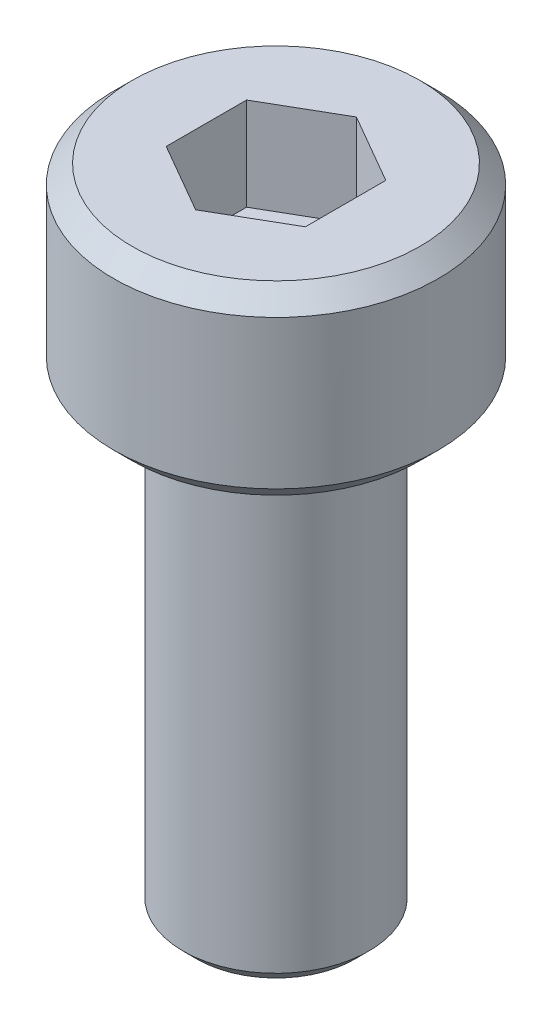
ISO-10303-21;
HEADER;
FILE_DESCRIPTION(('STEP AP214'),'2;1');
FILE_NAME('part.step','',(''),(''),'','','');
FILE_SCHEMA(('AUTOMOTIVE_DESIGN { 1 0 10303 214 1 1 1 1 }'));
ENDSEC;
DATA;
#1=APPLICATION_CONTEXT('core data for automotive mechanical design processes');
#2=APPLICATION_PROTOCOL_DEFINITION('international standard','automotive_design',2000,#1);
#3=PRODUCT_CONTEXT('',#1,'mechanical');
#4=PRODUCT('Part','Part','',(#3));
#5=PRODUCT_RELATED_PRODUCT_CATEGORY('part','',(#4));
#6=PRODUCT_DEFINITION_FORMATION('','',#4);
#7=PRODUCT_DEFINITION_CONTEXT('part definition',#1,'design');
#8=PRODUCT_DEFINITION('design','',#6,#7);
#9=PRODUCT_DEFINITION_SHAPE('','',#8);
#10=(LENGTH_UNIT() NAMED_UNIT(*) SI_UNIT(.MILLI.,.METRE.));
#11=(NAMED_UNIT(*) PLANE_ANGLE_UNIT() SI_UNIT($,.RADIAN.));
#12=(NAMED_UNIT(*) SI_UNIT($,.STERADIAN.) SOLID_ANGLE_UNIT());
#13=UNCERTAINTY_MEASURE_WITH_UNIT(LENGTH_MEASURE(1.E-05),#10,'distance_accuracy_value','');
#14=(GEOMETRIC_REPRESENTATION_CONTEXT(3) GLOBAL_UNCERTAINTY_ASSIGNED_CONTEXT((#13)) GLOBAL_UNIT_ASSIGNED_CONTEXT((#10,
#11,#12)) REPRESENTATION_CONTEXT('',''));
#15=CARTESIAN_POINT('',(0.,0.,0.));
#16=DIRECTION('',(0.,0.,1.));
#17=DIRECTION('',(1.,0.,0.));
#18=AXIS2_PLACEMENT_3D('',#15,#16,#17);
#19=CARTESIAN_POINT('',(0.,2.,-1.73205080756888));
#20=DIRECTION('',(-0.500000000000001,0.,-0.866025403784438));
#21=DIRECTION('',(-0.866025403784438,0.,0.500000000000001));
#22=AXIS2_PLACEMENT_3D('',#19,#20,#21);
#23=PLANE('',#22);
#24=DIRECTION('',(0.,1.,0.));
#25=VECTOR('',#24,1.);
#26=CARTESIAN_POINT('',(-1.5,2.,-0.866025403784438));
#27=LINE('',#26,#25);
#28=CARTESIAN_POINT('',(-1.5,4.,-0.866025403784437));
#29=VERTEX_POINT('',#28);
#30=CARTESIAN_POINT('',(-1.5,2.,-0.866025403784437));
#31=VERTEX_POINT('',#30);
#32=EDGE_CURVE('E82',#29,#31,#27,.F.);
#33=ORIENTED_EDGE('',*,*,#32,.T.);
#34=DIRECTION('',(-0.866025403784438,0.,0.500000000000001));
#35=VECTOR('',#34,1.);
#36=CARTESIAN_POINT('',(0.,2.,-1.73205080756888));
#37=LINE('',#36,#35);
#38=CARTESIAN_POINT('',(0.,2.,-1.73205080756888));
#39=VERTEX_POINT('',#38);
#40=EDGE_CURVE('E71',#39,#31,#37,.T.);
#41=ORIENTED_EDGE('',*,*,#40,.F.);
#42=DIRECTION('',(0.,1.,0.));
#43=VECTOR('',#42,1.);
#44=CARTESIAN_POINT('',(0.,2.,-1.73205080756888));
#45=LINE('',#44,#43);
#46=CARTESIAN_POINT('',(0.,4.,-1.73205080756888));
#47=VERTEX_POINT('',#46);
#48=EDGE_CURVE('E91',#39,#47,#45,.T.);
#49=ORIENTED_EDGE('',*,*,#48,.T.);
#50=DIRECTION('',(-0.866025403784438,0.,0.500000000000001));
#51=VECTOR('',#50,1.);
#52=CARTESIAN_POINT('',(0.,4.,-1.73205080756888));
#53=LINE('',#52,#51);
#54=EDGE_CURVE('E66',#29,#47,#53,.F.);
#55=ORIENTED_EDGE('',*,*,#54,.F.);
#56=EDGE_LOOP('',(#33,#41,#49,#55));
#57=FACE_BOUND('',#56,.T.);
#58=ADVANCED_FACE('F16',(#57),#23,.F.);
#59=CARTESIAN_POINT('',(-1.5,2.,-0.866025403784438));
#60=DIRECTION('',(-1.,0.,0.));
#61=DIRECTION('',(0.,0.,1.));
#62=AXIS2_PLACEMENT_3D('',#59,#60,#61);
#63=PLANE('',#62);
#64=DIRECTION('',(0.,1.,0.));
#65=VECTOR('',#64,1.);
#66=CARTESIAN_POINT('',(-1.5,2.,0.866025403784439));
#67=LINE('',#66,#65);
#68=CARTESIAN_POINT('',(-1.5,4.,0.866025403784439));
#69=VERTEX_POINT('',#68);
#70=CARTESIAN_POINT('',(-1.5,2.,0.866025403784439));
#71=VERTEX_POINT('',#70);
#72=EDGE_CURVE('E87',#69,#71,#67,.F.);
#73=ORIENTED_EDGE('',*,*,#72,.T.);
#74=DIRECTION('',(0.,0.,1.));
#75=VECTOR('',#74,1.);
#76=CARTESIAN_POINT('',(-1.5,2.,-0.866025403784438));
#77=LINE('',#76,#75);
#78=EDGE_CURVE('E75',#31,#71,#77,.T.);
#79=ORIENTED_EDGE('',*,*,#78,.F.);
#80=ORIENTED_EDGE('',*,*,#32,.F.);
#81=DIRECTION('',(0.,0.,1.));
#82=VECTOR('',#81,1.);
#83=CARTESIAN_POINT('',(-1.5,4.,-0.866025403784438));
#84=LINE('',#83,#82);
#85=EDGE_CURVE('E89',#69,#29,#84,.F.);
#86=ORIENTED_EDGE('',*,*,#85,.F.);
#87=EDGE_LOOP('',(#73,#79,#80,#86));
#88=FACE_BOUND('',#87,.T.);
#89=ADVANCED_FACE('F85',(#88),#63,.F.);
#90=CARTESIAN_POINT('',(1.5,2.,-0.866025403784438));
#91=DIRECTION('',(0.5,0.,-0.866025403784439));
#92=DIRECTION('',(-0.866025403784439,0.,-0.5));
#93=AXIS2_PLACEMENT_3D('',#90,#91,#92);
#94=PLANE('',#93);
#95=ORIENTED_EDGE('',*,*,#48,.F.);
#96=DIRECTION('',(-0.866025403784439,0.,-0.5));
#97=VECTOR('',#96,1.);
#98=CARTESIAN_POINT('',(1.5,2.,-0.866025403784438));
#99=LINE('',#98,#97);
#100=CARTESIAN_POINT('',(1.5,2.,-0.866025403784438));
#101=VERTEX_POINT('',#100);
#102=EDGE_CURVE('E78',#101,#39,#99,.T.);
#103=ORIENTED_EDGE('',*,*,#102,.F.);
#104=DIRECTION('',(0.,1.,0.));
#105=VECTOR('',#104,1.);
#106=CARTESIAN_POINT('',(1.5,2.,-0.866025403784438));
#107=LINE('',#106,#105);
#108=CARTESIAN_POINT('',(1.5,4.,-0.866025403784438));
#109=VERTEX_POINT('',#108);
#110=EDGE_CURVE('E124',#101,#109,#107,.T.);
#111=ORIENTED_EDGE('',*,*,#110,.T.);
#112=DIRECTION('',(-0.866025403784439,0.,-0.5));
#113=VECTOR('',#112,1.);
#114=CARTESIAN_POINT('',(1.5,4.,-0.866025403784438));
#115=LINE('',#114,#113);
#116=EDGE_CURVE('E136',#47,#109,#115,.F.);
#117=ORIENTED_EDGE('',*,*,#116,.F.);
#118=EDGE_LOOP('',(#95,#103,#111,#117));
#119=FACE_BOUND('',#118,.T.);
#120=ADVANCED_FACE('F139',(#119),#94,.F.);
#121=CARTESIAN_POINT('',(-1.5,2.,0.866025403784439));
#122=DIRECTION('',(-0.499999999999999,0.,0.866025403784439));
#123=DIRECTION('',(0.866025403784439,0.,0.499999999999999));
#124=AXIS2_PLACEMENT_3D('',#121,#122,#123);
#125=PLANE('',#124);
#126=DIRECTION('',(0.,1.,0.));
#127=VECTOR('',#126,1.);
#128=CARTESIAN_POINT('',(0.,2.,1.73205080756888));
#129=LINE('',#128,#127);
#130=CARTESIAN_POINT('',(0.,4.,1.73205080756888));
#131=VERTEX_POINT('',#130);
#132=CARTESIAN_POINT('',(0.,2.,1.73205080756888));
#133=VERTEX_POINT('',#132);
#134=EDGE_CURVE('E121',#131,#133,#129,.F.);
#135=ORIENTED_EDGE('',*,*,#134,.T.);
#136=DIRECTION('',(0.866025403784439,0.,0.499999999999999));
#137=VECTOR('',#136,1.);
#138=CARTESIAN_POINT('',(-1.5,2.,0.866025403784439));
#139=LINE('',#138,#137);
#140=EDGE_CURVE('E130',#71,#133,#139,.T.);
#141=ORIENTED_EDGE('',*,*,#140,.F.);
#142=ORIENTED_EDGE('',*,*,#72,.F.);
#143=DIRECTION('',(0.866025403784439,0.,0.499999999999999));
#144=VECTOR('',#143,1.);
#145=CARTESIAN_POINT('',(-1.5,4.,0.866025403784439));
#146=LINE('',#145,#144);
#147=EDGE_CURVE('E132',#131,#69,#146,.F.);
#148=ORIENTED_EDGE('',*,*,#147,.F.);
#149=EDGE_LOOP('',(#135,#141,#142,#148));
#150=FACE_BOUND('',#149,.T.);
#151=ADVANCED_FACE('F146',(#150),#125,.F.);
#152=CARTESIAN_POINT('',(1.5,2.,2.59807621135331));
#153=DIRECTION('',(0.,1.,0.));
#154=DIRECTION('',(0.,0.,1.));
#155=AXIS2_PLACEMENT_3D('',#152,#153,#154);
#156=PLANE('',#155);
#157=ORIENTED_EDGE('',*,*,#40,.T.);
#158=ORIENTED_EDGE('',*,*,#78,.T.);
#159=ORIENTED_EDGE('',*,*,#140,.T.);
#160=DIRECTION('',(0.866025403784438,0.,-0.5));
#161=VECTOR('',#160,1.);
#162=CARTESIAN_POINT('',(0.,2.,1.73205080756888));
#163=LINE('',#162,#161);
#164=CARTESIAN_POINT('',(1.5,2.,0.866025403784438));
#165=VERTEX_POINT('',#164);
#166=EDGE_CURVE('E119',#133,#165,#163,.T.);
#167=ORIENTED_EDGE('',*,*,#166,.T.);
#168=DIRECTION('',(0.,0.,-1.));
#169=VECTOR('',#168,1.);
#170=CARTESIAN_POINT('',(1.5,2.,0.866025403784438));
#171=LINE('',#170,#169);
#172=EDGE_CURVE('E127',#165,#101,#171,.T.);
#173=ORIENTED_EDGE('',*,*,#172,.T.);
#174=ORIENTED_EDGE('',*,*,#102,.T.);
#175=EDGE_LOOP('',(#157,#158,#159,#167,#173,#174));
#176=FACE_BOUND('',#175,.T.);
#177=ADVANCED_FACE('F72',(#176),#156,.T.);
#178=CARTESIAN_POINT('',(1.5,2.,0.866025403784438));
#179=DIRECTION('',(1.,0.,0.));
#180=DIRECTION('',(0.,0.,-1.));
#181=AXIS2_PLACEMENT_3D('',#178,#179,#180);
#182=PLANE('',#181);
#183=ORIENTED_EDGE('',*,*,#110,.F.);
#184=ORIENTED_EDGE('',*,*,#172,.F.);
#185=DIRECTION('',(0.,1.,0.));
#186=VECTOR('',#185,1.);
#187=CARTESIAN_POINT('',(1.5,2.,0.866025403784437));
#188=LINE('',#187,#186);
#189=CARTESIAN_POINT('',(1.5,4.,0.866025403784438));
#190=VERTEX_POINT('',#189);
#191=EDGE_CURVE('E117',#165,#190,#188,.T.);
#192=ORIENTED_EDGE('',*,*,#191,.T.);
#193=DIRECTION('',(0.,0.,-1.));
#194=VECTOR('',#193,1.);
#195=CARTESIAN_POINT('',(1.5,4.,0.866025403784438));
#196=LINE('',#195,#194);
#197=EDGE_CURVE('E34',#109,#190,#196,.F.);
#198=ORIENTED_EDGE('',*,*,#197,.F.);
#199=EDGE_LOOP('',(#183,#184,#192,#198));
#200=FACE_BOUND('',#199,.T.);
#201=ADVANCED_FACE('F153',(#200),#182,.F.);
#202=CARTESIAN_POINT('',(0.,2.,1.73205080756888));
#203=DIRECTION('',(0.5,0.,0.866025403784438));
#204=DIRECTION('',(0.866025403784438,0.,-0.5));
#205=AXIS2_PLACEMENT_3D('',#202,#203,#204);
#206=PLANE('',#205);
#207=ORIENTED_EDGE('',*,*,#191,.F.);
#208=ORIENTED_EDGE('',*,*,#166,.F.);
#209=ORIENTED_EDGE('',*,*,#134,.F.);
#210=DIRECTION('',(-0.866025403784438,0.,0.5));
#211=VECTOR('',#210,1.);
#212=CARTESIAN_POINT('',(1.5,4.,0.866025403784438));
#213=LINE('',#212,#211);
#214=EDGE_CURVE('E115',#190,#131,#213,.T.);
#215=ORIENTED_EDGE('',*,*,#214,.F.);
#216=EDGE_LOOP('',(#207,#208,#209,#215));
#217=FACE_BOUND('',#216,.T.);
#218=ADVANCED_FACE('F151',(#217),#206,.F.);
#219=CARTESIAN_POINT('',(0.,4.,0.));
#220=DIRECTION('',(0.,1.,0.));
#221=DIRECTION('',(0.,0.,1.));
#222=AXIS2_PLACEMENT_3D('',#219,#220,#221);
#223=PLANE('',#222);
#224=ORIENTED_EDGE('',*,*,#197,.T.);
#225=ORIENTED_EDGE('',*,*,#214,.T.);
#226=ORIENTED_EDGE('',*,*,#147,.T.);
#227=ORIENTED_EDGE('',*,*,#85,.T.);
#228=ORIENTED_EDGE('',*,*,#54,.T.);
#229=ORIENTED_EDGE('',*,*,#116,.T.);
#230=EDGE_LOOP('',(#224,#225,#226,#227,#228,#229));
#231=FACE_BOUND('',#230,.T.);
#232=CARTESIAN_POINT('',(0.,4.0000000000191,0.));
#233=DIRECTION('',(0.,-1.,0.));
#234=DIRECTION('',(0.,0.,-1.));
#235=AXIS2_PLACEMENT_3D('',#232,#233,#234);
#236=CIRCLE('',#235,3.10000000001764);
#237=CARTESIAN_POINT('',(0.,4.0000000000191,-3.10000000001764));
#238=VERTEX_POINT('',#237);
#239=EDGE_CURVE('E19',#238,#238,#236,.T.);
#240=ORIENTED_EDGE('',*,*,#239,.F.);
#241=EDGE_LOOP('',(#240));
#242=FACE_BOUND('',#241,.T.);
#243=ADVANCED_FACE('F141',(#231,#242),#223,.T.);
#244=CARTESIAN_POINT('',(0.,3.60000000000582,0.));
#245=DIRECTION('',(0.,-1.,0.));
#246=DIRECTION('',(0.,0.,-1.));
#247=AXIS2_PLACEMENT_3D('',#244,#245,#246);
#248=CONICAL_SURFACE('',#247,3.50000000003092,0.785398163397448);
#249=ORIENTED_EDGE('',*,*,#239,.T.);
#250=EDGE_LOOP('',(#249));
#251=FACE_BOUND('',#250,.T.);
#252=CARTESIAN_POINT('',(0.,3.6,0.));
#253=DIRECTION('',(0.,-1.,0.));
#254=DIRECTION('',(0.,0.,-1.));
#255=AXIS2_PLACEMENT_3D('',#252,#253,#254);
#256=CIRCLE('',#255,3.5);
#257=CARTESIAN_POINT('',(0.,3.6,-3.5));
#258=VERTEX_POINT('',#257);
#259=EDGE_CURVE('E106',#258,#258,#256,.T.);
#260=ORIENTED_EDGE('',*,*,#259,.F.);
#261=EDGE_LOOP('',(#260));
#262=FACE_BOUND('',#261,.T.);
#263=ADVANCED_FACE('F190',(#251,#262),#248,.T.);
#264=CARTESIAN_POINT('',(0.,4.,0.));
#265=DIRECTION('',(0.,-1.,0.));
#266=DIRECTION('',(0.,0.,-1.));
#267=AXIS2_PLACEMENT_3D('',#264,#265,#266);
#268=CYLINDRICAL_SURFACE('',#267,3.5);
#269=ORIENTED_EDGE('',*,*,#259,.T.);
#270=EDGE_LOOP('',(#269));
#271=FACE_BOUND('',#270,.T.);
#272=CARTESIAN_POINT('',(0.,0.400000000013279,0.));
#273=DIRECTION('',(0.,1.,0.));
#274=DIRECTION('',(0.,0.,1.));
#275=AXIS2_PLACEMENT_3D('',#272,#273,#274);
#276=CIRCLE('',#275,3.50000000003092);
#277=CARTESIAN_POINT('',(0.,0.400000000013279,3.50000000003092));
#278=VERTEX_POINT('',#277);
#279=EDGE_CURVE('E101',#278,#278,#276,.F.);
#280=ORIENTED_EDGE('',*,*,#279,.F.);
#281=EDGE_LOOP('',(#280));
#282=FACE_BOUND('',#281,.T.);
#283=ADVANCED_FACE('F186',(#271,#282),#268,.T.);
#284=CARTESIAN_POINT('',(0.,-10.,0.));
#285=DIRECTION('',(0.,1.,0.));
#286=DIRECTION('',(0.,0.,1.));
#287=AXIS2_PLACEMENT_3D('',#284,#285,#286);
#288=PLANE('',#287);
#289=CARTESIAN_POINT('',(0.,-9.99999999999091,0.));
#290=DIRECTION('',(0.,1.,0.));
#291=DIRECTION('',(0.,0.,1.));
#292=AXIS2_PLACEMENT_3D('',#289,#290,#291);
#293=CIRCLE('',#292,1.70000000008486);
#294=CARTESIAN_POINT('',(0.,-9.99999999999091,1.70000000008486));
#295=VERTEX_POINT('',#294);
#296=EDGE_CURVE('E99',#295,#295,#293,.T.);
#297=ORIENTED_EDGE('',*,*,#296,.F.);
#298=EDGE_LOOP('',(#297));
#299=FACE_BOUND('',#298,.T.);
#300=ADVANCED_FACE('F182',(#299),#288,.F.);
#301=CARTESIAN_POINT('',(0.,0.399999999956435,0.));
#302=DIRECTION('',(0.,1.,0.));
#303=DIRECTION('',(0.,0.,1.));
#304=AXIS2_PLACEMENT_3D('',#301,#302,#303);
#305=CONICAL_SURFACE('',#304,3.49999999991724,0.785398163326394);
#306=CARTESIAN_POINT('',(0.,5.6843418860808E-11,0.));
#307=DIRECTION('',(0.,1.,0.));
#308=DIRECTION('',(0.,0.,1.));
#309=AXIS2_PLACEMENT_3D('',#306,#307,#308);
#310=CIRCLE('',#309,3.10000000007449);
#311=CARTESIAN_POINT('',(0.,5.6843418860808E-11,3.10000000007449));
#312=VERTEX_POINT('',#311);
#313=EDGE_CURVE('E96',#312,#312,#310,.T.);
#314=ORIENTED_EDGE('',*,*,#313,.T.);
#315=EDGE_LOOP('',(#314));
#316=FACE_BOUND('',#315,.T.);
#317=ORIENTED_EDGE('',*,*,#279,.T.);
#318=EDGE_LOOP('',(#317));
#319=FACE_BOUND('',#318,.T.);
#320=ADVANCED_FACE('F178',(#316,#319),#305,.T.);
#321=CARTESIAN_POINT('',(0.,-9.70000000012305,0.));
#322=DIRECTION('',(0.,1.,0.));
#323=DIRECTION('',(0.,0.,1.));
#324=AXIS2_PLACEMENT_3D('',#321,#322,#323);
#325=CONICAL_SURFACE('',#324,1.99999999995271,0.785398163397448);
#326=CARTESIAN_POINT('',(0.,-9.7,0.));
#327=DIRECTION('',(0.,1.,0.));
#328=DIRECTION('',(0.,0.,1.));
#329=AXIS2_PLACEMENT_3D('',#326,#327,#328);
#330=CIRCLE('',#329,2.);
#331=CARTESIAN_POINT('',(0.,-9.7,2.));
#332=VERTEX_POINT('',#331);
#333=EDGE_CURVE('E25',#332,#332,#330,.T.);
#334=ORIENTED_EDGE('',*,*,#333,.F.);
#335=EDGE_LOOP('',(#334));
#336=FACE_BOUND('',#335,.T.);
#337=ORIENTED_EDGE('',*,*,#296,.T.);
#338=EDGE_LOOP('',(#337));
#339=FACE_BOUND('',#338,.T.);
#340=ADVANCED_FACE('F171',(#336,#339),#325,.T.);
#341=CARTESIAN_POINT('',(0.,0.,0.));
#342=DIRECTION('',(0.,1.,0.));
#343=DIRECTION('',(0.,0.,1.));
#344=AXIS2_PLACEMENT_3D('',#341,#342,#343);
#345=PLANE('',#344);
#346=CARTESIAN_POINT('',(0.,0.,0.));
#347=DIRECTION('',(0.,1.,0.));
#348=DIRECTION('',(0.,0.,1.));
#349=AXIS2_PLACEMENT_3D('',#346,#347,#348);
#350=CIRCLE('',#349,2.);
#351=CARTESIAN_POINT('',(0.,0.,2.));
#352=VERTEX_POINT('',#351);
#353=EDGE_CURVE('E11',#352,#352,#350,.F.);
#354=ORIENTED_EDGE('',*,*,#353,.F.);
#355=EDGE_LOOP('',(#354));
#356=FACE_BOUND('',#355,.T.);
#357=ORIENTED_EDGE('',*,*,#313,.F.);
#358=EDGE_LOOP('',(#357));
#359=FACE_BOUND('',#358,.T.);
#360=ADVANCED_FACE('F165',(#356,#359),#345,.F.);
#361=CARTESIAN_POINT('',(0.,-10.,0.));
#362=DIRECTION('',(0.,1.,0.));
#363=DIRECTION('',(0.,0.,1.));
#364=AXIS2_PLACEMENT_3D('',#361,#362,#363);
#365=CYLINDRICAL_SURFACE('',#364,2.);
#366=ORIENTED_EDGE('',*,*,#353,.T.);
#367=EDGE_LOOP('',(#366));
#368=FACE_BOUND('',#367,.T.);
#369=ORIENTED_EDGE('',*,*,#333,.T.);
#370=EDGE_LOOP('',(#369));
#371=FACE_BOUND('',#370,.T.);
#372=ADVANCED_FACE('F163',(#368,#371),#365,.T.);
#373=CLOSED_SHELL('',(#58,#89,#120,#151,#177,#201,#218,#243,#263,#283,#300,#320,#340,#360,#372));
#374=MANIFOLD_SOLID_BREP('B1',#373);
#375=ADVANCED_BREP_SHAPE_REPRESENTATION('',(#18,#374),#14);
#376=SHAPE_DEFINITION_REPRESENTATION(#9,#375);
ENDSEC;
END-ISO-10303-21;
